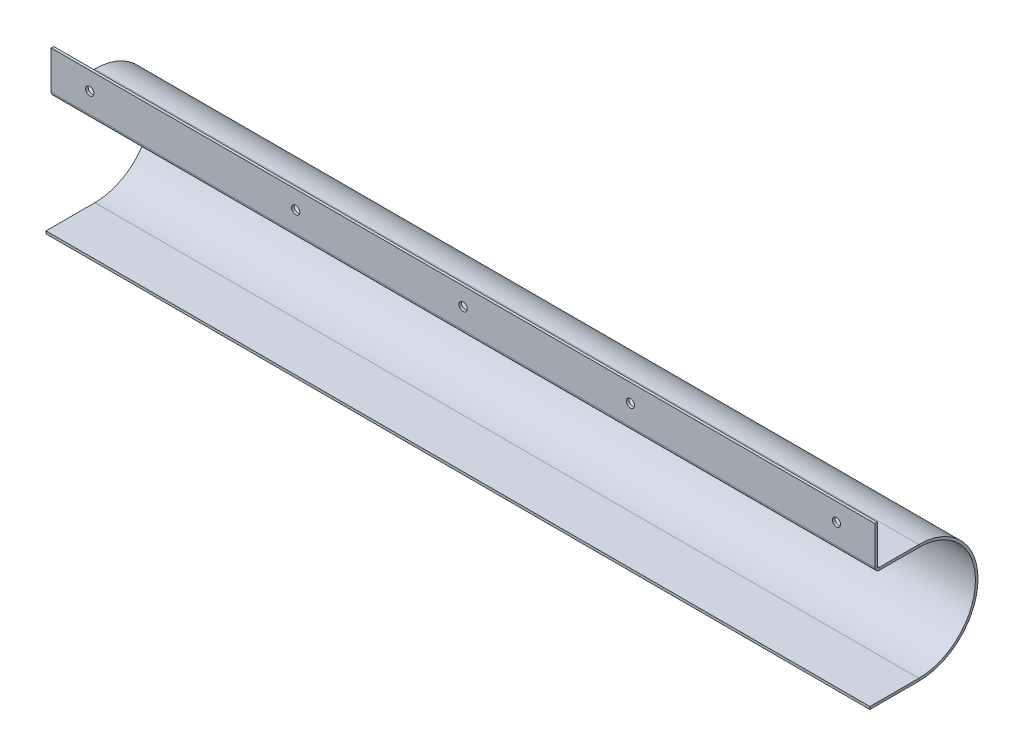
ISO-10303-21;
HEADER;
FILE_DESCRIPTION(('STEP AP214'),'2;1');
FILE_NAME('part.step','',(''),(''),'','','');
FILE_SCHEMA(('AUTOMOTIVE_DESIGN { 1 0 10303 214 1 1 1 1 }'));
ENDSEC;
DATA;
#1=APPLICATION_CONTEXT('core data for automotive mechanical design processes');
#2=APPLICATION_PROTOCOL_DEFINITION('international standard','automotive_design',2000,#1);
#3=PRODUCT_CONTEXT('',#1,'mechanical');
#4=PRODUCT('Part','Part','',(#3));
#5=PRODUCT_RELATED_PRODUCT_CATEGORY('part','',(#4));
#6=PRODUCT_DEFINITION_FORMATION('','',#4);
#7=PRODUCT_DEFINITION_CONTEXT('part definition',#1,'design');
#8=PRODUCT_DEFINITION('design','',#6,#7);
#9=PRODUCT_DEFINITION_SHAPE('','',#8);
#10=(LENGTH_UNIT() NAMED_UNIT(*) SI_UNIT(.MILLI.,.METRE.));
#11=(NAMED_UNIT(*) PLANE_ANGLE_UNIT() SI_UNIT($,.RADIAN.));
#12=(NAMED_UNIT(*) SI_UNIT($,.STERADIAN.) SOLID_ANGLE_UNIT());
#13=UNCERTAINTY_MEASURE_WITH_UNIT(LENGTH_MEASURE(1.E-05),#10,'distance_accuracy_value','');
#14=(GEOMETRIC_REPRESENTATION_CONTEXT(3) GLOBAL_UNCERTAINTY_ASSIGNED_CONTEXT((#13)) GLOBAL_UNIT_ASSIGNED_CONTEXT((#10,
#11,#12)) REPRESENTATION_CONTEXT('',''));
#15=CARTESIAN_POINT('',(0.,0.,0.));
#16=DIRECTION('',(0.,0.,1.));
#17=DIRECTION('',(1.,0.,0.));
#18=AXIS2_PLACEMENT_3D('',#15,#16,#17);
#19=CARTESIAN_POINT('',(160.,0.,0.));
#20=DIRECTION('',(-1.,0.,0.));
#21=DIRECTION('',(0.,0.,1.));
#22=AXIS2_PLACEMENT_3D('',#19,#20,#21);
#23=PLANE('',#22);
#24=DIRECTION('',(0.,0.,-1.));
#25=VECTOR('',#24,1.);
#26=CARTESIAN_POINT('',(160.,23.,32.0000000000002));
#27=LINE('',#26,#25);
#28=CARTESIAN_POINT('',(160.,23.,15.2634000000002));
#29=VERTEX_POINT('',#28);
#30=CARTESIAN_POINT('',(160.,23.,1.49186218934005E-13));
#31=VERTEX_POINT('',#30);
#32=EDGE_CURVE('E115',#29,#31,#27,.T.);
#33=ORIENTED_EDGE('',*,*,#32,.F.);
#34=DIRECTION('',(0.,-1.,0.));
#35=VECTOR('',#34,1.);
#36=CARTESIAN_POINT('',(160.,0.,15.2634000000002));
#37=LINE('',#36,#35);
#38=CARTESIAN_POINT('',(160.,22.,15.2634000000002));
#39=VERTEX_POINT('',#38);
#40=EDGE_CURVE('E12',#29,#39,#37,.T.);
#41=ORIENTED_EDGE('',*,*,#40,.T.);
#42=DIRECTION('',(0.,0.,-1.));
#43=VECTOR('',#42,1.);
#44=CARTESIAN_POINT('',(160.,22.,32.0000000000002));
#45=LINE('',#44,#43);
#46=CARTESIAN_POINT('',(160.,22.,1.40317346463108E-13));
#47=VERTEX_POINT('',#46);
#48=EDGE_CURVE('E126',#39,#47,#45,.T.);
#49=ORIENTED_EDGE('',*,*,#48,.T.);
#50=DIRECTION('',(0.,1.,0.));
#51=VECTOR('',#50,1.);
#52=CARTESIAN_POINT('',(160.,22.,1.40317346463108E-13));
#53=LINE('',#52,#51);
#54=EDGE_CURVE('E130',#47,#31,#53,.T.);
#55=ORIENTED_EDGE('',*,*,#54,.T.);
#56=EDGE_LOOP('',(#33,#41,#49,#55));
#57=FACE_BOUND('',#56,.T.);
#58=ADVANCED_FACE('F42',(#57),#23,.F.);
#59=CARTESIAN_POINT('',(160.,22.,32.0000000000002));
#60=DIRECTION('',(0.,1.,0.));
#61=DIRECTION('',(0.,0.,1.));
#62=AXIS2_PLACEMENT_3D('',#59,#60,#61);
#63=PLANE('',#62);
#64=ORIENTED_EDGE('',*,*,#48,.F.);
#65=DIRECTION('',(-1.,0.,0.));
#66=VECTOR('',#65,1.);
#67=CARTESIAN_POINT('',(160.,22.,15.2634000000002));
#68=LINE('',#67,#66);
#69=CARTESIAN_POINT('',(-160.,22.,15.2634000000002));
#70=VERTEX_POINT('',#69);
#71=EDGE_CURVE('E50',#39,#70,#68,.T.);
#72=ORIENTED_EDGE('',*,*,#71,.T.);
#73=DIRECTION('',(0.,0.,-1.));
#74=VECTOR('',#73,1.);
#75=CARTESIAN_POINT('',(-160.,22.,32.0000000000002));
#76=LINE('',#75,#74);
#77=CARTESIAN_POINT('',(-160.,22.,1.40317346463108E-13));
#78=VERTEX_POINT('',#77);
#79=EDGE_CURVE('E171',#70,#78,#76,.T.);
#80=ORIENTED_EDGE('',*,*,#79,.T.);
#81=DIRECTION('',(-1.,0.,0.));
#82=VECTOR('',#81,1.);
#83=CARTESIAN_POINT('',(160.,22.,1.40317346463108E-13));
#84=LINE('',#83,#82);
#85=EDGE_CURVE('E143',#47,#78,#84,.T.);
#86=ORIENTED_EDGE('',*,*,#85,.F.);
#87=EDGE_LOOP('',(#64,#72,#80,#86));
#88=FACE_BOUND('',#87,.T.);
#89=ADVANCED_FACE('F288',(#88),#63,.F.);
#90=CARTESIAN_POINT('',(160.,-23.,0.));
#91=DIRECTION('',(1.,0.,0.));
#92=DIRECTION('',(0.,0.,-1.));
#93=AXIS2_PLACEMENT_3D('',#90,#91,#92);
#94=PLANE('',#93);
#95=DIRECTION('',(0.,1.,0.));
#96=VECTOR('',#95,1.);
#97=CARTESIAN_POINT('',(160.,-23.,0.));
#98=LINE('',#97,#96);
#99=CARTESIAN_POINT('',(160.,-23.,0.));
#100=VERTEX_POINT('',#99);
#101=CARTESIAN_POINT('',(160.,-22.,0.));
#102=VERTEX_POINT('',#101);
#103=EDGE_CURVE('E67',#100,#102,#98,.T.);
#104=ORIENTED_EDGE('',*,*,#103,.F.);
#105=CARTESIAN_POINT('',(160.,0.,0.));
#106=DIRECTION('',(-1.,0.,0.));
#107=DIRECTION('',(0.,0.,-1.));
#108=AXIS2_PLACEMENT_3D('',#105,#106,#107);
#109=CIRCLE('',#108,23.);
#110=EDGE_CURVE('E127',#31,#100,#109,.T.);
#111=ORIENTED_EDGE('',*,*,#110,.F.);
#112=ORIENTED_EDGE('',*,*,#54,.F.);
#113=CARTESIAN_POINT('',(160.,0.,0.));
#114=DIRECTION('',(1.,0.,0.));
#115=DIRECTION('',(0.,0.,-1.));
#116=AXIS2_PLACEMENT_3D('',#113,#114,#115);
#117=CIRCLE('',#116,22.);
#118=EDGE_CURVE('E154',#47,#102,#117,.F.);
#119=ORIENTED_EDGE('',*,*,#118,.T.);
#120=EDGE_LOOP('',(#104,#111,#112,#119));
#121=FACE_BOUND('',#120,.T.);
#122=ADVANCED_FACE('F145',(#121),#94,.T.);
#123=CARTESIAN_POINT('',(160.,22.,1.40317346463108E-13));
#124=DIRECTION('',(1.,0.,0.));
#125=DIRECTION('',(0.,0.,-1.));
#126=AXIS2_PLACEMENT_3D('',#123,#124,#125);
#127=PLANE('',#126);
#128=DIRECTION('',(0.,0.,1.));
#129=VECTOR('',#128,1.);
#130=CARTESIAN_POINT('',(160.,-23.,0.));
#131=LINE('',#130,#129);
#132=CARTESIAN_POINT('',(160.,-23.,19.));
#133=VERTEX_POINT('',#132);
#134=EDGE_CURVE('E147',#100,#133,#131,.T.);
#135=ORIENTED_EDGE('',*,*,#134,.F.);
#136=ORIENTED_EDGE('',*,*,#103,.T.);
#137=DIRECTION('',(0.,0.,1.));
#138=VECTOR('',#137,1.);
#139=CARTESIAN_POINT('',(160.,-22.,0.));
#140=LINE('',#139,#138);
#141=CARTESIAN_POINT('',(160.,-22.,19.));
#142=VERTEX_POINT('',#141);
#143=EDGE_CURVE('E101',#102,#142,#140,.T.);
#144=ORIENTED_EDGE('',*,*,#143,.T.);
#145=DIRECTION('',(0.,1.,0.));
#146=VECTOR('',#145,1.);
#147=CARTESIAN_POINT('',(160.,-23.,19.));
#148=LINE('',#147,#146);
#149=EDGE_CURVE('E150',#133,#142,#148,.T.);
#150=ORIENTED_EDGE('',*,*,#149,.F.);
#151=EDGE_LOOP('',(#135,#136,#144,#150));
#152=FACE_BOUND('',#151,.T.);
#153=ADVANCED_FACE('F272',(#152),#127,.T.);
#154=CARTESIAN_POINT('',(-160.,23.,1.49186218934005E-13));
#155=DIRECTION('',(-1.,0.,0.));
#156=DIRECTION('',(0.,0.,1.));
#157=AXIS2_PLACEMENT_3D('',#154,#155,#156);
#158=PLANE('',#157);
#159=DIRECTION('',(0.,-1.,0.));
#160=VECTOR('',#159,1.);
#161=CARTESIAN_POINT('',(-160.,23.,1.49186218934005E-13));
#162=LINE('',#161,#160);
#163=CARTESIAN_POINT('',(-160.,23.,1.49186218934005E-13));
#164=VERTEX_POINT('',#163);
#165=EDGE_CURVE('E135',#164,#78,#162,.T.);
#166=ORIENTED_EDGE('',*,*,#165,.F.);
#167=CARTESIAN_POINT('',(-160.,0.,0.));
#168=DIRECTION('',(-1.,0.,0.));
#169=DIRECTION('',(0.,0.,-1.));
#170=AXIS2_PLACEMENT_3D('',#167,#168,#169);
#171=CIRCLE('',#170,23.);
#172=CARTESIAN_POINT('',(-160.,-23.,0.));
#173=VERTEX_POINT('',#172);
#174=EDGE_CURVE('E141',#164,#173,#171,.T.);
#175=ORIENTED_EDGE('',*,*,#174,.T.);
#176=DIRECTION('',(0.,-1.,0.));
#177=VECTOR('',#176,1.);
#178=CARTESIAN_POINT('',(-160.,-22.,0.));
#179=LINE('',#178,#177);
#180=CARTESIAN_POINT('',(-160.,-22.,0.));
#181=VERTEX_POINT('',#180);
#182=EDGE_CURVE('E95',#181,#173,#179,.T.);
#183=ORIENTED_EDGE('',*,*,#182,.F.);
#184=CARTESIAN_POINT('',(-160.,0.,0.));
#185=DIRECTION('',(1.,0.,0.));
#186=DIRECTION('',(0.,0.,-1.));
#187=AXIS2_PLACEMENT_3D('',#184,#185,#186);
#188=CIRCLE('',#187,22.);
#189=EDGE_CURVE('E169',#78,#181,#188,.F.);
#190=ORIENTED_EDGE('',*,*,#189,.F.);
#191=EDGE_LOOP('',(#166,#175,#183,#190));
#192=FACE_BOUND('',#191,.T.);
#193=ADVANCED_FACE('F278',(#192),#158,.T.);
#194=CARTESIAN_POINT('',(-160.,-22.,0.));
#195=DIRECTION('',(-1.,0.,0.));
#196=DIRECTION('',(0.,0.,1.));
#197=AXIS2_PLACEMENT_3D('',#194,#195,#196);
#198=PLANE('',#197);
#199=DIRECTION('',(0.,-1.,0.));
#200=VECTOR('',#199,1.);
#201=CARTESIAN_POINT('',(-160.,-22.,15.2634000000002));
#202=LINE('',#201,#200);
#203=CARTESIAN_POINT('',(-160.,23.,15.2634000000002));
#204=VERTEX_POINT('',#203);
#205=EDGE_CURVE('E186',#204,#70,#202,.T.);
#206=ORIENTED_EDGE('',*,*,#205,.F.);
#207=DIRECTION('',(0.,0.,-1.));
#208=VECTOR('',#207,1.);
#209=CARTESIAN_POINT('',(-160.,23.,32.0000000000002));
#210=LINE('',#209,#208);
#211=EDGE_CURVE('E168',#204,#164,#210,.T.);
#212=ORIENTED_EDGE('',*,*,#211,.T.);
#213=ORIENTED_EDGE('',*,*,#165,.T.);
#214=ORIENTED_EDGE('',*,*,#79,.F.);
#215=EDGE_LOOP('',(#206,#212,#213,#214));
#216=FACE_BOUND('',#215,.T.);
#217=ADVANCED_FACE('F282',(#216),#198,.T.);
#218=CARTESIAN_POINT('',(160.,-22.,0.));
#219=DIRECTION('',(0.,-1.,0.));
#220=DIRECTION('',(0.,0.,-1.));
#221=AXIS2_PLACEMENT_3D('',#218,#219,#220);
#222=PLANE('',#221);
#223=DIRECTION('',(0.,0.,1.));
#224=VECTOR('',#223,1.);
#225=CARTESIAN_POINT('',(-160.,-22.,0.));
#226=LINE('',#225,#224);
#227=CARTESIAN_POINT('',(-160.,-22.,19.));
#228=VERTEX_POINT('',#227);
#229=EDGE_CURVE('E157',#181,#228,#226,.T.);
#230=ORIENTED_EDGE('',*,*,#229,.T.);
#231=DIRECTION('',(-1.,0.,0.));
#232=VECTOR('',#231,1.);
#233=CARTESIAN_POINT('',(160.,-22.,19.));
#234=LINE('',#233,#232);
#235=EDGE_CURVE('E179',#142,#228,#234,.T.);
#236=ORIENTED_EDGE('',*,*,#235,.F.);
#237=ORIENTED_EDGE('',*,*,#143,.F.);
#238=DIRECTION('',(-1.,0.,0.));
#239=VECTOR('',#238,1.);
#240=CARTESIAN_POINT('',(160.,-22.,0.));
#241=LINE('',#240,#239);
#242=EDGE_CURVE('E156',#102,#181,#241,.T.);
#243=ORIENTED_EDGE('',*,*,#242,.T.);
#244=EDGE_LOOP('',(#230,#236,#237,#243));
#245=FACE_BOUND('',#244,.T.);
#246=ADVANCED_FACE('F359',(#245),#222,.F.);
#247=CARTESIAN_POINT('',(160.,-23.,19.));
#248=DIRECTION('',(0.,0.,1.));
#249=DIRECTION('',(1.,0.,0.));
#250=AXIS2_PLACEMENT_3D('',#247,#248,#249);
#251=PLANE('',#250);
#252=DIRECTION('',(0.,1.,0.));
#253=VECTOR('',#252,1.);
#254=CARTESIAN_POINT('',(-160.,-23.,19.));
#255=LINE('',#254,#253);
#256=CARTESIAN_POINT('',(-160.,-23.,19.));
#257=VERTEX_POINT('',#256);
#258=EDGE_CURVE('E160',#257,#228,#255,.T.);
#259=ORIENTED_EDGE('',*,*,#258,.F.);
#260=DIRECTION('',(-1.,0.,0.));
#261=VECTOR('',#260,1.);
#262=CARTESIAN_POINT('',(160.,-23.,19.));
#263=LINE('',#262,#261);
#264=EDGE_CURVE('E177',#133,#257,#263,.T.);
#265=ORIENTED_EDGE('',*,*,#264,.F.);
#266=ORIENTED_EDGE('',*,*,#149,.T.);
#267=ORIENTED_EDGE('',*,*,#235,.T.);
#268=EDGE_LOOP('',(#259,#265,#266,#267));
#269=FACE_BOUND('',#268,.T.);
#270=ADVANCED_FACE('F271',(#269),#251,.T.);
#271=CARTESIAN_POINT('',(160.,-23.,0.));
#272=DIRECTION('',(0.,-1.,0.));
#273=DIRECTION('',(0.,0.,-1.));
#274=AXIS2_PLACEMENT_3D('',#271,#272,#273);
#275=PLANE('',#274);
#276=DIRECTION('',(0.,0.,1.));
#277=VECTOR('',#276,1.);
#278=CARTESIAN_POINT('',(-160.,-23.,0.));
#279=LINE('',#278,#277);
#280=EDGE_CURVE('E164',#173,#257,#279,.T.);
#281=ORIENTED_EDGE('',*,*,#280,.F.);
#282=DIRECTION('',(-1.,0.,0.));
#283=VECTOR('',#282,1.);
#284=CARTESIAN_POINT('',(160.,-23.,0.));
#285=LINE('',#284,#283);
#286=EDGE_CURVE('E142',#100,#173,#285,.T.);
#287=ORIENTED_EDGE('',*,*,#286,.F.);
#288=ORIENTED_EDGE('',*,*,#134,.T.);
#289=ORIENTED_EDGE('',*,*,#264,.T.);
#290=EDGE_LOOP('',(#281,#287,#288,#289));
#291=FACE_BOUND('',#290,.T.);
#292=ADVANCED_FACE('F275',(#291),#275,.T.);
#293=CARTESIAN_POINT('',(160.,0.,0.));
#294=DIRECTION('',(-1.,0.,0.));
#295=DIRECTION('',(0.,0.,1.));
#296=AXIS2_PLACEMENT_3D('',#293,#294,#295);
#297=CYLINDRICAL_SURFACE('',#296,23.);
#298=ORIENTED_EDGE('',*,*,#174,.F.);
#299=DIRECTION('',(-1.,0.,0.));
#300=VECTOR('',#299,1.);
#301=CARTESIAN_POINT('',(160.,23.,1.49186218934005E-13));
#302=LINE('',#301,#300);
#303=EDGE_CURVE('E120',#31,#164,#302,.T.);
#304=ORIENTED_EDGE('',*,*,#303,.F.);
#305=ORIENTED_EDGE('',*,*,#110,.T.);
#306=ORIENTED_EDGE('',*,*,#286,.T.);
#307=EDGE_LOOP('',(#298,#304,#305,#306));
#308=FACE_BOUND('',#307,.T.);
#309=ADVANCED_FACE('F139',(#308),#297,.T.);
#310=CARTESIAN_POINT('',(160.,23.,32.0000000000002));
#311=DIRECTION('',(0.,1.,0.));
#312=DIRECTION('',(0.,0.,1.));
#313=AXIS2_PLACEMENT_3D('',#310,#311,#312);
#314=PLANE('',#313);
#315=DIRECTION('',(-1.,0.,0.));
#316=VECTOR('',#315,1.);
#317=CARTESIAN_POINT('',(160.,23.,15.2634000000002));
#318=LINE('',#317,#316);
#319=EDGE_CURVE('E124',#29,#204,#318,.T.);
#320=ORIENTED_EDGE('',*,*,#319,.F.);
#321=ORIENTED_EDGE('',*,*,#32,.T.);
#322=ORIENTED_EDGE('',*,*,#303,.T.);
#323=ORIENTED_EDGE('',*,*,#211,.F.);
#324=EDGE_LOOP('',(#320,#321,#322,#323));
#325=FACE_BOUND('',#324,.T.);
#326=ADVANCED_FACE('F117',(#325),#314,.T.);
#327=CARTESIAN_POINT('',(160.,0.,0.));
#328=DIRECTION('',(-1.,0.,0.));
#329=DIRECTION('',(0.,0.,1.));
#330=AXIS2_PLACEMENT_3D('',#327,#328,#329);
#331=CYLINDRICAL_SURFACE('',#330,22.);
#332=ORIENTED_EDGE('',*,*,#189,.T.);
#333=ORIENTED_EDGE('',*,*,#242,.F.);
#334=ORIENTED_EDGE('',*,*,#118,.F.);
#335=ORIENTED_EDGE('',*,*,#85,.T.);
#336=EDGE_LOOP('',(#332,#333,#334,#335));
#337=FACE_BOUND('',#336,.T.);
#338=ADVANCED_FACE('F285',(#337),#331,.F.);
#339=CARTESIAN_POINT('',(-160.,0.,0.));
#340=DIRECTION('',(-1.,0.,0.));
#341=DIRECTION('',(0.,0.,1.));
#342=AXIS2_PLACEMENT_3D('',#339,#340,#341);
#343=PLANE('',#342);
#344=ORIENTED_EDGE('',*,*,#229,.F.);
#345=ORIENTED_EDGE('',*,*,#182,.T.);
#346=ORIENTED_EDGE('',*,*,#280,.T.);
#347=ORIENTED_EDGE('',*,*,#258,.T.);
#348=EDGE_LOOP('',(#344,#345,#346,#347));
#349=FACE_BOUND('',#348,.T.);
#350=ADVANCED_FACE('F377',(#349),#343,.T.);
#351=CARTESIAN_POINT('',(160.,23.7366,15.2634000000002));
#352=DIRECTION('',(-1.,0.,0.));
#353=DIRECTION('',(0.,0.,1.));
#354=AXIS2_PLACEMENT_3D('',#351,#352,#353);
#355=PLANE('',#354);
#356=DIRECTION('',(0.,0.,1.));
#357=VECTOR('',#356,1.);
#358=CARTESIAN_POINT('',(160.,23.7366000000001,39.0000000000001));
#359=LINE('',#358,#357);
#360=CARTESIAN_POINT('',(160.,23.7366,16.0000000000002));
#361=VERTEX_POINT('',#360);
#362=CARTESIAN_POINT('',(160.,23.7366,17.0000000000002));
#363=VERTEX_POINT('',#362);
#364=EDGE_CURVE('E197',#361,#363,#359,.T.);
#365=ORIENTED_EDGE('',*,*,#364,.T.);
#366=CARTESIAN_POINT('',(160.,23.7366,15.2634000000002));
#367=DIRECTION('',(1.,0.,0.));
#368=DIRECTION('',(0.,0.,-1.));
#369=AXIS2_PLACEMENT_3D('',#366,#367,#368);
#370=CIRCLE('',#369,1.7366);
#371=EDGE_CURVE('E58',#363,#39,#370,.T.);
#372=ORIENTED_EDGE('',*,*,#371,.T.);
#373=ORIENTED_EDGE('',*,*,#40,.F.);
#374=CARTESIAN_POINT('',(160.,23.7366,15.2634000000002));
#375=DIRECTION('',(1.,0.,0.));
#376=DIRECTION('',(0.,0.,-1.));
#377=AXIS2_PLACEMENT_3D('',#374,#375,#376);
#378=CIRCLE('',#377,0.7366);
#379=EDGE_CURVE('E259',#361,#29,#378,.T.);
#380=ORIENTED_EDGE('',*,*,#379,.F.);
#381=EDGE_LOOP('',(#365,#372,#373,#380));
#382=FACE_BOUND('',#381,.T.);
#383=ADVANCED_FACE('F316',(#382),#355,.F.);
#384=CARTESIAN_POINT('',(-160.,23.7366,15.2634000000002));
#385=DIRECTION('',(1.,0.,0.));
#386=DIRECTION('',(0.,0.,-1.));
#387=AXIS2_PLACEMENT_3D('',#384,#385,#386);
#388=PLANE('',#387);
#389=CARTESIAN_POINT('',(-160.,23.7366,15.2634000000002));
#390=DIRECTION('',(1.,0.,0.));
#391=DIRECTION('',(0.,0.,-1.));
#392=AXIS2_PLACEMENT_3D('',#389,#390,#391);
#393=CIRCLE('',#392,1.7366);
#394=CARTESIAN_POINT('',(-160.,23.7366,17.0000000000002));
#395=VERTEX_POINT('',#394);
#396=EDGE_CURVE('E262',#70,#395,#393,.F.);
#397=ORIENTED_EDGE('',*,*,#396,.T.);
#398=DIRECTION('',(0.,0.,1.));
#399=VECTOR('',#398,1.);
#400=CARTESIAN_POINT('',(-160.,23.7366000000002,61.0000000000001));
#401=LINE('',#400,#399);
#402=CARTESIAN_POINT('',(-160.,23.7366,16.0000000000002));
#403=VERTEX_POINT('',#402);
#404=EDGE_CURVE('E237',#403,#395,#401,.T.);
#405=ORIENTED_EDGE('',*,*,#404,.F.);
#406=CARTESIAN_POINT('',(-160.,23.7366,15.2634000000002));
#407=DIRECTION('',(-1.,0.,0.));
#408=DIRECTION('',(0.,0.,-1.));
#409=AXIS2_PLACEMENT_3D('',#406,#407,#408);
#410=CIRCLE('',#409,0.7366);
#411=EDGE_CURVE('E161',#204,#403,#410,.T.);
#412=ORIENTED_EDGE('',*,*,#411,.F.);
#413=ORIENTED_EDGE('',*,*,#205,.T.);
#414=EDGE_LOOP('',(#397,#405,#412,#413));
#415=FACE_BOUND('',#414,.T.);
#416=ADVANCED_FACE('F299',(#415),#388,.F.);
#417=CARTESIAN_POINT('',(-320.007457880795,23.7366,15.2634000000002));
#418=DIRECTION('',(1.,0.,0.));
#419=DIRECTION('',(0.,0.,-1.));
#420=AXIS2_PLACEMENT_3D('',#417,#418,#419);
#421=CYLINDRICAL_SURFACE('',#420,0.7366);
#422=ORIENTED_EDGE('',*,*,#319,.T.);
#423=ORIENTED_EDGE('',*,*,#411,.T.);
#424=DIRECTION('',(-1.,0.,0.));
#425=VECTOR('',#424,1.);
#426=CARTESIAN_POINT('',(160.,23.7366,16.0000000000002));
#427=LINE('',#426,#425);
#428=EDGE_CURVE('E243',#361,#403,#427,.T.);
#429=ORIENTED_EDGE('',*,*,#428,.F.);
#430=ORIENTED_EDGE('',*,*,#379,.T.);
#431=EDGE_LOOP('',(#422,#423,#429,#430));
#432=FACE_BOUND('',#431,.T.);
#433=ADVANCED_FACE('F313',(#432),#421,.F.);
#434=CARTESIAN_POINT('',(-320.007457880795,23.7366,15.2634000000002));
#435=DIRECTION('',(1.,0.,0.));
#436=DIRECTION('',(0.,0.,-1.));
#437=AXIS2_PLACEMENT_3D('',#434,#435,#436);
#438=CYLINDRICAL_SURFACE('',#437,1.7366);
#439=ORIENTED_EDGE('',*,*,#71,.F.);
#440=ORIENTED_EDGE('',*,*,#371,.F.);
#441=DIRECTION('',(-1.,0.,0.));
#442=VECTOR('',#441,1.);
#443=CARTESIAN_POINT('',(160.,23.7366,17.0000000000002));
#444=LINE('',#443,#442);
#445=EDGE_CURVE('E255',#363,#395,#444,.T.);
#446=ORIENTED_EDGE('',*,*,#445,.T.);
#447=ORIENTED_EDGE('',*,*,#396,.F.);
#448=EDGE_LOOP('',(#439,#440,#446,#447));
#449=FACE_BOUND('',#448,.T.);
#450=ADVANCED_FACE('F293',(#449),#438,.T.);
#451=CARTESIAN_POINT('',(160.,38.5307532622854,17.0000000000001));
#452=DIRECTION('',(0.,1.,0.));
#453=DIRECTION('',(1.,0.,0.));
#454=AXIS2_PLACEMENT_3D('',#451,#452,#453);
#455=PLANE('',#454);
#456=DIRECTION('',(0.,0.,-1.));
#457=VECTOR('',#456,1.);
#458=CARTESIAN_POINT('',(-160.,38.5307532622854,17.0000000000001));
#459=LINE('',#458,#457);
#460=CARTESIAN_POINT('',(-160.,38.5307532622854,17.0000000000001));
#461=VERTEX_POINT('',#460);
#462=CARTESIAN_POINT('',(-160.,38.5307532622854,16.0000000000001));
#463=VERTEX_POINT('',#462);
#464=EDGE_CURVE('E234',#461,#463,#459,.T.);
#465=ORIENTED_EDGE('',*,*,#464,.F.);
#466=DIRECTION('',(-1.,0.,0.));
#467=VECTOR('',#466,1.);
#468=CARTESIAN_POINT('',(160.,38.5307532622854,17.0000000000001));
#469=LINE('',#468,#467);
#470=CARTESIAN_POINT('',(160.,38.5307532622854,17.0000000000001));
#471=VERTEX_POINT('',#470);
#472=EDGE_CURVE('E231',#471,#461,#469,.T.);
#473=ORIENTED_EDGE('',*,*,#472,.F.);
#474=DIRECTION('',(0.,0.,-1.));
#475=VECTOR('',#474,1.);
#476=CARTESIAN_POINT('',(160.,38.5307532622854,17.0000000000001));
#477=LINE('',#476,#475);
#478=CARTESIAN_POINT('',(160.,38.5307532622854,16.0000000000001));
#479=VERTEX_POINT('',#478);
#480=EDGE_CURVE('E252',#471,#479,#477,.T.);
#481=ORIENTED_EDGE('',*,*,#480,.T.);
#482=DIRECTION('',(-1.,0.,0.));
#483=VECTOR('',#482,1.);
#484=CARTESIAN_POINT('',(160.,38.5307532622854,16.0000000000001));
#485=LINE('',#484,#483);
#486=EDGE_CURVE('E249',#479,#463,#485,.T.);
#487=ORIENTED_EDGE('',*,*,#486,.T.);
#488=EDGE_LOOP('',(#465,#473,#481,#487));
#489=FACE_BOUND('',#488,.T.);
#490=ADVANCED_FACE('F331',(#489),#455,.T.);
#491=CARTESIAN_POINT('',(160.,38.5307532622854,16.0000000000001));
#492=DIRECTION('',(0.,0.,-1.));
#493=DIRECTION('',(0.,1.,0.));
#494=AXIS2_PLACEMENT_3D('',#491,#492,#493);
#495=PLANE('',#494);
#496=CARTESIAN_POINT('',(65.,31.5307532622854,16.0000000000001));
#497=DIRECTION('',(0.,0.,-1.));
#498=DIRECTION('',(0.,1.,0.));
#499=AXIS2_PLACEMENT_3D('',#496,#497,#498);
#500=CIRCLE('',#499,1.60000000000001);
#501=CARTESIAN_POINT('',(65.,33.1307532622854,16.0000000000001));
#502=VERTEX_POINT('',#501);
#503=EDGE_CURVE('E218',#502,#502,#500,.T.);
#504=ORIENTED_EDGE('',*,*,#503,.F.);
#505=EDGE_LOOP('',(#504));
#506=FACE_BOUND('',#505,.T.);
#507=CARTESIAN_POINT('',(145.,31.5307532622854,16.0000000000001));
#508=DIRECTION('',(0.,0.,-1.));
#509=DIRECTION('',(0.,1.,0.));
#510=AXIS2_PLACEMENT_3D('',#507,#508,#509);
#511=CIRCLE('',#510,1.59999999999999);
#512=CARTESIAN_POINT('',(145.,33.1307532622854,16.0000000000001));
#513=VERTEX_POINT('',#512);
#514=EDGE_CURVE('E208',#513,#513,#511,.T.);
#515=ORIENTED_EDGE('',*,*,#514,.F.);
#516=EDGE_LOOP('',(#515));
#517=FACE_BOUND('',#516,.T.);
#518=CARTESIAN_POINT('',(-65.,31.5307532622854,16.0000000000001));
#519=DIRECTION('',(0.,0.,-1.));
#520=DIRECTION('',(0.,1.,0.));
#521=AXIS2_PLACEMENT_3D('',#518,#519,#520);
#522=CIRCLE('',#521,1.60000000000001);
#523=CARTESIAN_POINT('',(-65.,33.1307532622854,16.0000000000001));
#524=VERTEX_POINT('',#523);
#525=EDGE_CURVE('E205',#524,#524,#522,.T.);
#526=ORIENTED_EDGE('',*,*,#525,.F.);
#527=EDGE_LOOP('',(#526));
#528=FACE_BOUND('',#527,.T.);
#529=CARTESIAN_POINT('',(-145.,31.5307532622854,16.0000000000001));
#530=DIRECTION('',(0.,0.,-1.));
#531=DIRECTION('',(0.,1.,0.));
#532=AXIS2_PLACEMENT_3D('',#529,#530,#531);
#533=CIRCLE('',#532,1.59999999999999);
#534=CARTESIAN_POINT('',(-145.,33.1307532622854,16.0000000000001));
#535=VERTEX_POINT('',#534);
#536=EDGE_CURVE('E202',#535,#535,#533,.T.);
#537=ORIENTED_EDGE('',*,*,#536,.F.);
#538=EDGE_LOOP('',(#537));
#539=FACE_BOUND('',#538,.T.);
#540=CARTESIAN_POINT('',(0.,31.5307532622854,16.0000000000001));
#541=DIRECTION('',(0.,0.,-1.));
#542=DIRECTION('',(0.,1.,0.));
#543=AXIS2_PLACEMENT_3D('',#540,#541,#542);
#544=CIRCLE('',#543,1.6);
#545=CARTESIAN_POINT('',(0.,33.1307532622854,16.0000000000001));
#546=VERTEX_POINT('',#545);
#547=EDGE_CURVE('E198',#546,#546,#544,.T.);
#548=ORIENTED_EDGE('',*,*,#547,.F.);
#549=EDGE_LOOP('',(#548));
#550=FACE_BOUND('',#549,.T.);
#551=DIRECTION('',(0.,-1.,0.));
#552=VECTOR('',#551,1.);
#553=CARTESIAN_POINT('',(160.,38.5307532622854,16.0000000000001));
#554=LINE('',#553,#552);
#555=EDGE_CURVE('E246',#479,#361,#554,.T.);
#556=ORIENTED_EDGE('',*,*,#555,.T.);
#557=ORIENTED_EDGE('',*,*,#428,.T.);
#558=DIRECTION('',(0.,-1.,0.));
#559=VECTOR('',#558,1.);
#560=CARTESIAN_POINT('',(-160.,38.5307532622854,16.0000000000001));
#561=LINE('',#560,#559);
#562=EDGE_CURVE('E240',#463,#403,#561,.T.);
#563=ORIENTED_EDGE('',*,*,#562,.F.);
#564=ORIENTED_EDGE('',*,*,#486,.F.);
#565=EDGE_LOOP('',(#556,#557,#563,#564));
#566=FACE_BOUND('',#565,.T.);
#567=ADVANCED_FACE('F325',(#506,#517,#528,#539,#550,#566),#495,.T.);
#568=CARTESIAN_POINT('',(-160.,6.53075326228543,61.0000000000002));
#569=DIRECTION('',(-1.,0.,0.));
#570=DIRECTION('',(0.,1.,0.));
#571=AXIS2_PLACEMENT_3D('',#568,#569,#570);
#572=PLANE('',#571);
#573=ORIENTED_EDGE('',*,*,#562,.T.);
#574=ORIENTED_EDGE('',*,*,#404,.T.);
#575=DIRECTION('',(0.,-1.,0.));
#576=VECTOR('',#575,1.);
#577=CARTESIAN_POINT('',(-160.,38.5307532622854,17.0000000000001));
#578=LINE('',#577,#576);
#579=EDGE_CURVE('E228',#461,#395,#578,.T.);
#580=ORIENTED_EDGE('',*,*,#579,.F.);
#581=ORIENTED_EDGE('',*,*,#464,.T.);
#582=EDGE_LOOP('',(#573,#574,#580,#581));
#583=FACE_BOUND('',#582,.T.);
#584=ADVANCED_FACE('F337',(#583),#572,.T.);
#585=CARTESIAN_POINT('',(160.,38.5307532622854,17.0000000000001));
#586=DIRECTION('',(0.,0.,-1.));
#587=DIRECTION('',(0.,1.,0.));
#588=AXIS2_PLACEMENT_3D('',#585,#586,#587);
#589=PLANE('',#588);
#590=CARTESIAN_POINT('',(65.,31.5307532622854,17.0000000000001));
#591=DIRECTION('',(0.,0.,-1.));
#592=DIRECTION('',(0.,1.,0.));
#593=AXIS2_PLACEMENT_3D('',#590,#591,#592);
#594=CIRCLE('',#593,1.60000000000001);
#595=CARTESIAN_POINT('',(65.,33.1307532622854,17.0000000000001));
#596=VERTEX_POINT('',#595);
#597=EDGE_CURVE('E45',#596,#596,#594,.T.);
#598=ORIENTED_EDGE('',*,*,#597,.T.);
#599=EDGE_LOOP('',(#598));
#600=FACE_BOUND('',#599,.T.);
#601=CARTESIAN_POINT('',(145.,31.5307532622854,17.0000000000001));
#602=DIRECTION('',(0.,0.,-1.));
#603=DIRECTION('',(0.,1.,0.));
#604=AXIS2_PLACEMENT_3D('',#601,#602,#603);
#605=CIRCLE('',#604,1.59999999999999);
#606=CARTESIAN_POINT('',(145.,33.1307532622854,17.0000000000001));
#607=VERTEX_POINT('',#606);
#608=EDGE_CURVE('E206',#607,#607,#605,.T.);
#609=ORIENTED_EDGE('',*,*,#608,.T.);
#610=EDGE_LOOP('',(#609));
#611=FACE_BOUND('',#610,.T.);
#612=CARTESIAN_POINT('',(-65.,31.5307532622854,17.0000000000001));
#613=DIRECTION('',(0.,0.,-1.));
#614=DIRECTION('',(0.,1.,0.));
#615=AXIS2_PLACEMENT_3D('',#612,#613,#614);
#616=CIRCLE('',#615,1.60000000000001);
#617=CARTESIAN_POINT('',(-65.,33.1307532622854,17.0000000000001));
#618=VERTEX_POINT('',#617);
#619=EDGE_CURVE('E203',#618,#618,#616,.T.);
#620=ORIENTED_EDGE('',*,*,#619,.T.);
#621=EDGE_LOOP('',(#620));
#622=FACE_BOUND('',#621,.T.);
#623=CARTESIAN_POINT('',(-145.,31.5307532622854,17.0000000000001));
#624=DIRECTION('',(0.,0.,-1.));
#625=DIRECTION('',(0.,1.,0.));
#626=AXIS2_PLACEMENT_3D('',#623,#624,#625);
#627=CIRCLE('',#626,1.59999999999999);
#628=CARTESIAN_POINT('',(-145.,33.1307532622854,17.0000000000001));
#629=VERTEX_POINT('',#628);
#630=EDGE_CURVE('E199',#629,#629,#627,.T.);
#631=ORIENTED_EDGE('',*,*,#630,.T.);
#632=EDGE_LOOP('',(#631));
#633=FACE_BOUND('',#632,.T.);
#634=CARTESIAN_POINT('',(0.,31.5307532622854,17.0000000000001));
#635=DIRECTION('',(0.,0.,-1.));
#636=DIRECTION('',(0.,1.,0.));
#637=AXIS2_PLACEMENT_3D('',#634,#635,#636);
#638=CIRCLE('',#637,1.6);
#639=CARTESIAN_POINT('',(0.,33.1307532622854,17.0000000000001));
#640=VERTEX_POINT('',#639);
#641=EDGE_CURVE('E194',#640,#640,#638,.T.);
#642=ORIENTED_EDGE('',*,*,#641,.T.);
#643=EDGE_LOOP('',(#642));
#644=FACE_BOUND('',#643,.T.);
#645=ORIENTED_EDGE('',*,*,#445,.F.);
#646=DIRECTION('',(0.,-1.,0.));
#647=VECTOR('',#646,1.);
#648=CARTESIAN_POINT('',(160.,38.5307532622854,17.0000000000001));
#649=LINE('',#648,#647);
#650=EDGE_CURVE('E225',#471,#363,#649,.T.);
#651=ORIENTED_EDGE('',*,*,#650,.F.);
#652=ORIENTED_EDGE('',*,*,#472,.T.);
#653=ORIENTED_EDGE('',*,*,#579,.T.);
#654=EDGE_LOOP('',(#645,#651,#652,#653));
#655=FACE_BOUND('',#654,.T.);
#656=ADVANCED_FACE('F335',(#600,#611,#622,#633,#644,#655),#589,.F.);
#657=CARTESIAN_POINT('',(160.,6.53075326228535,39.0000000000002));
#658=DIRECTION('',(-1.,0.,0.));
#659=DIRECTION('',(0.,1.,0.));
#660=AXIS2_PLACEMENT_3D('',#657,#658,#659);
#661=PLANE('',#660);
#662=ORIENTED_EDGE('',*,*,#364,.F.);
#663=ORIENTED_EDGE('',*,*,#555,.F.);
#664=ORIENTED_EDGE('',*,*,#480,.F.);
#665=ORIENTED_EDGE('',*,*,#650,.T.);
#666=EDGE_LOOP('',(#662,#663,#664,#665));
#667=FACE_BOUND('',#666,.T.);
#668=ADVANCED_FACE('F319',(#667),#661,.F.);
#669=CARTESIAN_POINT('',(0.,31.5307532622854,18.0000000000001));
#670=DIRECTION('',(0.,0.,-1.));
#671=DIRECTION('',(0.,1.,0.));
#672=AXIS2_PLACEMENT_3D('',#669,#670,#671);
#673=CYLINDRICAL_SURFACE('',#672,1.6);
#674=ORIENTED_EDGE('',*,*,#547,.T.);
#675=EDGE_LOOP('',(#674));
#676=FACE_BOUND('',#675,.T.);
#677=ORIENTED_EDGE('',*,*,#641,.F.);
#678=EDGE_LOOP('',(#677));
#679=FACE_BOUND('',#678,.T.);
#680=ADVANCED_FACE('F389',(#676,#679),#673,.F.);
#681=CARTESIAN_POINT('',(-145.,31.5307532622854,18.0000000000001));
#682=DIRECTION('',(0.,0.,-1.));
#683=DIRECTION('',(0.,1.,0.));
#684=AXIS2_PLACEMENT_3D('',#681,#682,#683);
#685=CYLINDRICAL_SURFACE('',#684,1.59999999999999);
#686=ORIENTED_EDGE('',*,*,#536,.T.);
#687=EDGE_LOOP('',(#686));
#688=FACE_BOUND('',#687,.T.);
#689=ORIENTED_EDGE('',*,*,#630,.F.);
#690=EDGE_LOOP('',(#689));
#691=FACE_BOUND('',#690,.T.);
#692=ADVANCED_FACE('F393',(#688,#691),#685,.F.);
#693=CARTESIAN_POINT('',(-65.,31.5307532622854,18.0000000000001));
#694=DIRECTION('',(0.,0.,-1.));
#695=DIRECTION('',(0.,1.,0.));
#696=AXIS2_PLACEMENT_3D('',#693,#694,#695);
#697=CYLINDRICAL_SURFACE('',#696,1.60000000000001);
#698=ORIENTED_EDGE('',*,*,#525,.T.);
#699=EDGE_LOOP('',(#698));
#700=FACE_BOUND('',#699,.T.);
#701=ORIENTED_EDGE('',*,*,#619,.F.);
#702=EDGE_LOOP('',(#701));
#703=FACE_BOUND('',#702,.T.);
#704=ADVANCED_FACE('F399',(#700,#703),#697,.F.);
#705=CARTESIAN_POINT('',(145.,31.5307532622854,18.0000000000001));
#706=DIRECTION('',(0.,0.,-1.));
#707=DIRECTION('',(0.,1.,0.));
#708=AXIS2_PLACEMENT_3D('',#705,#706,#707);
#709=CYLINDRICAL_SURFACE('',#708,1.59999999999999);
#710=ORIENTED_EDGE('',*,*,#514,.T.);
#711=EDGE_LOOP('',(#710));
#712=FACE_BOUND('',#711,.T.);
#713=ORIENTED_EDGE('',*,*,#608,.F.);
#714=EDGE_LOOP('',(#713));
#715=FACE_BOUND('',#714,.T.);
#716=ADVANCED_FACE('F446',(#712,#715),#709,.F.);
#717=CARTESIAN_POINT('',(65.,31.5307532622854,18.0000000000001));
#718=DIRECTION('',(0.,0.,-1.));
#719=DIRECTION('',(0.,1.,0.));
#720=AXIS2_PLACEMENT_3D('',#717,#718,#719);
#721=CYLINDRICAL_SURFACE('',#720,1.60000000000001);
#722=ORIENTED_EDGE('',*,*,#503,.T.);
#723=EDGE_LOOP('',(#722));
#724=FACE_BOUND('',#723,.T.);
#725=ORIENTED_EDGE('',*,*,#597,.F.);
#726=EDGE_LOOP('',(#725));
#727=FACE_BOUND('',#726,.T.);
#728=ADVANCED_FACE('F456',(#724,#727),#721,.F.);
#729=CLOSED_SHELL('',(#58,#89,#122,#153,#193,#217,#246,#270,#292,#309,#326,#338,#350,#383,#416,
#433,#450,#490,#567,#584,#656,#668,#680,#692,#704,#716,#728));
#730=MANIFOLD_SOLID_BREP('B2',#729);
#731=ADVANCED_BREP_SHAPE_REPRESENTATION('',(#18,#730),#14);
#732=SHAPE_DEFINITION_REPRESENTATION(#9,#731);
ENDSEC;
END-ISO-10303-21;
